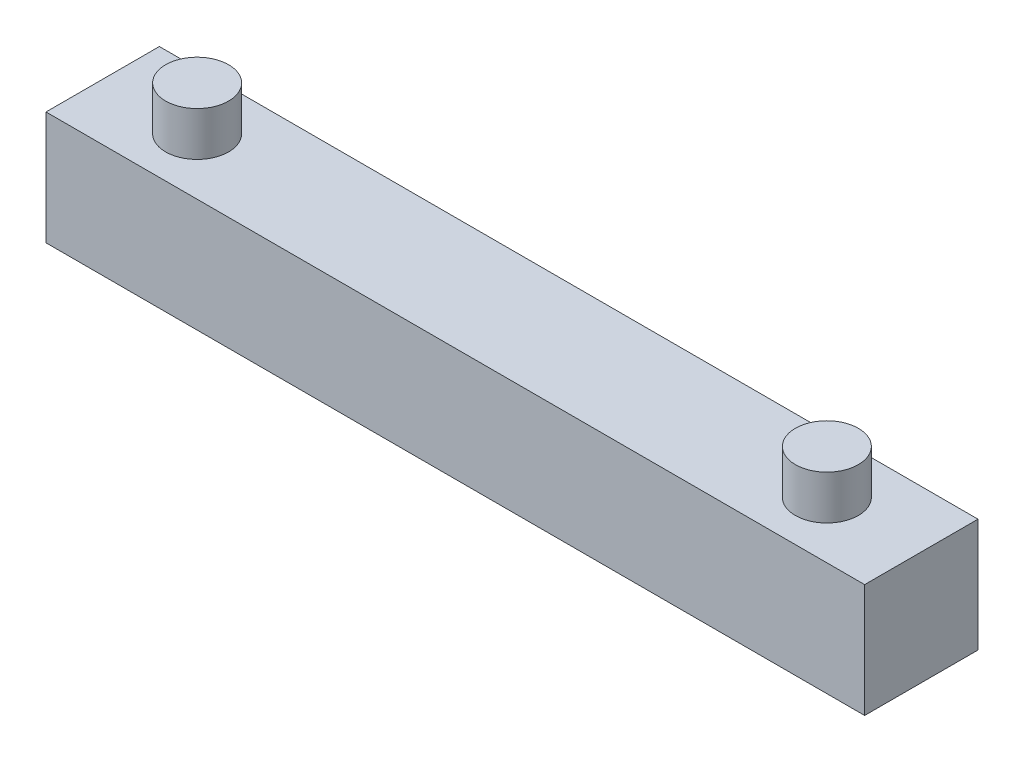
ISO-10303-21;
HEADER;
FILE_DESCRIPTION(('STEP AP214'),'2;1');
FILE_NAME('part.step','',(''),(''),'','','');
FILE_SCHEMA(('AUTOMOTIVE_DESIGN { 1 0 10303 214 1 1 1 1 }'));
ENDSEC;
DATA;
#1=APPLICATION_CONTEXT('core data for automotive mechanical design processes');
#2=APPLICATION_PROTOCOL_DEFINITION('international standard','automotive_design',2000,#1);
#3=PRODUCT_CONTEXT('',#1,'mechanical');
#4=PRODUCT('Part','Part','',(#3));
#5=PRODUCT_RELATED_PRODUCT_CATEGORY('part','',(#4));
#6=PRODUCT_DEFINITION_FORMATION('','',#4);
#7=PRODUCT_DEFINITION_CONTEXT('part definition',#1,'design');
#8=PRODUCT_DEFINITION('design','',#6,#7);
#9=PRODUCT_DEFINITION_SHAPE('','',#8);
#10=(LENGTH_UNIT() NAMED_UNIT(*) SI_UNIT(.MILLI.,.METRE.));
#11=(NAMED_UNIT(*) PLANE_ANGLE_UNIT() SI_UNIT($,.RADIAN.));
#12=(NAMED_UNIT(*) SI_UNIT($,.STERADIAN.) SOLID_ANGLE_UNIT());
#13=UNCERTAINTY_MEASURE_WITH_UNIT(LENGTH_MEASURE(1.E-05),#10,'distance_accuracy_value','');
#14=(GEOMETRIC_REPRESENTATION_CONTEXT(3) GLOBAL_UNCERTAINTY_ASSIGNED_CONTEXT((#13)) GLOBAL_UNIT_ASSIGNED_CONTEXT((#10,
#11,#12)) REPRESENTATION_CONTEXT('',''));
#15=CARTESIAN_POINT('',(0.,0.,0.));
#16=DIRECTION('',(0.,0.,1.));
#17=DIRECTION('',(1.,0.,0.));
#18=AXIS2_PLACEMENT_3D('',#15,#16,#17);
#19=CARTESIAN_POINT('',(32.5,9.,-4.5));
#20=DIRECTION('',(-1.,0.,0.));
#21=DIRECTION('',(0.,0.,1.));
#22=AXIS2_PLACEMENT_3D('',#19,#20,#21);
#23=PLANE('',#22);
#24=DIRECTION('',(0.,0.,-1.));
#25=VECTOR('',#24,1.);
#26=CARTESIAN_POINT('',(32.5,0.,-4.5));
#27=LINE('',#26,#25);
#28=CARTESIAN_POINT('',(32.5,0.,4.5));
#29=VERTEX_POINT('',#28);
#30=CARTESIAN_POINT('',(32.5,0.,-4.5));
#31=VERTEX_POINT('',#30);
#32=EDGE_CURVE('E111',#29,#31,#27,.T.);
#33=ORIENTED_EDGE('',*,*,#32,.T.);
#34=DIRECTION('',(0.,-1.,0.));
#35=VECTOR('',#34,1.);
#36=CARTESIAN_POINT('',(32.5,9.,-4.5));
#37=LINE('',#36,#35);
#38=CARTESIAN_POINT('',(32.5,9.,-4.5));
#39=VERTEX_POINT('',#38);
#40=EDGE_CURVE('E11',#39,#31,#37,.T.);
#41=ORIENTED_EDGE('',*,*,#40,.F.);
#42=DIRECTION('',(0.,0.,-1.));
#43=VECTOR('',#42,1.);
#44=CARTESIAN_POINT('',(32.5,9.,-4.5));
#45=LINE('',#44,#43);
#46=CARTESIAN_POINT('',(32.5,9.,4.5));
#47=VERTEX_POINT('',#46);
#48=EDGE_CURVE('E95',#47,#39,#45,.T.);
#49=ORIENTED_EDGE('',*,*,#48,.F.);
#50=DIRECTION('',(0.,-1.,0.));
#51=VECTOR('',#50,1.);
#52=CARTESIAN_POINT('',(32.5,9.,4.5));
#53=LINE('',#52,#51);
#54=EDGE_CURVE('E107',#47,#29,#53,.T.);
#55=ORIENTED_EDGE('',*,*,#54,.T.);
#56=EDGE_LOOP('',(#33,#41,#49,#55));
#57=FACE_BOUND('',#56,.T.);
#58=ADVANCED_FACE('F43',(#57),#23,.F.);
#59=CARTESIAN_POINT('',(-32.5,9.,-4.5));
#60=DIRECTION('',(0.,0.,1.));
#61=DIRECTION('',(1.,0.,0.));
#62=AXIS2_PLACEMENT_3D('',#59,#60,#61);
#63=PLANE('',#62);
#64=DIRECTION('',(-1.,0.,0.));
#65=VECTOR('',#64,1.);
#66=CARTESIAN_POINT('',(-32.5,0.,-4.5));
#67=LINE('',#66,#65);
#68=CARTESIAN_POINT('',(-32.5,0.,-4.5));
#69=VERTEX_POINT('',#68);
#70=EDGE_CURVE('E100',#31,#69,#67,.T.);
#71=ORIENTED_EDGE('',*,*,#70,.T.);
#72=DIRECTION('',(0.,-1.,0.));
#73=VECTOR('',#72,1.);
#74=CARTESIAN_POINT('',(-32.5,9.,-4.5));
#75=LINE('',#74,#73);
#76=CARTESIAN_POINT('',(-32.5,9.,-4.5));
#77=VERTEX_POINT('',#76);
#78=EDGE_CURVE('E52',#77,#69,#75,.T.);
#79=ORIENTED_EDGE('',*,*,#78,.F.);
#80=DIRECTION('',(-1.,0.,0.));
#81=VECTOR('',#80,1.);
#82=CARTESIAN_POINT('',(-32.5,9.,-4.5));
#83=LINE('',#82,#81);
#84=EDGE_CURVE('E90',#39,#77,#83,.T.);
#85=ORIENTED_EDGE('',*,*,#84,.F.);
#86=ORIENTED_EDGE('',*,*,#40,.T.);
#87=EDGE_LOOP('',(#71,#79,#85,#86));
#88=FACE_BOUND('',#87,.T.);
#89=ADVANCED_FACE('F99',(#88),#63,.F.);
#90=CARTESIAN_POINT('',(-32.5,9.,-4.5));
#91=DIRECTION('',(1.,0.,0.));
#92=DIRECTION('',(0.,0.,-1.));
#93=AXIS2_PLACEMENT_3D('',#90,#91,#92);
#94=PLANE('',#93);
#95=DIRECTION('',(0.,0.,1.));
#96=VECTOR('',#95,1.);
#97=CARTESIAN_POINT('',(-32.5,0.,-4.5));
#98=LINE('',#97,#96);
#99=CARTESIAN_POINT('',(-32.5,0.,4.5));
#100=VERTEX_POINT('',#99);
#101=EDGE_CURVE('E77',#69,#100,#98,.T.);
#102=ORIENTED_EDGE('',*,*,#101,.T.);
#103=DIRECTION('',(0.,-1.,0.));
#104=VECTOR('',#103,1.);
#105=CARTESIAN_POINT('',(-32.5,9.,4.5));
#106=LINE('',#105,#104);
#107=CARTESIAN_POINT('',(-32.5,9.,4.5));
#108=VERTEX_POINT('',#107);
#109=EDGE_CURVE('E102',#108,#100,#106,.T.);
#110=ORIENTED_EDGE('',*,*,#109,.F.);
#111=DIRECTION('',(0.,0.,1.));
#112=VECTOR('',#111,1.);
#113=CARTESIAN_POINT('',(-32.5,9.,-4.5));
#114=LINE('',#113,#112);
#115=EDGE_CURVE('E93',#77,#108,#114,.T.);
#116=ORIENTED_EDGE('',*,*,#115,.F.);
#117=ORIENTED_EDGE('',*,*,#78,.T.);
#118=EDGE_LOOP('',(#102,#110,#116,#117));
#119=FACE_BOUND('',#118,.T.);
#120=ADVANCED_FACE('F103',(#119),#94,.F.);
#121=CARTESIAN_POINT('',(-32.5,9.,4.5));
#122=DIRECTION('',(0.,0.,-1.));
#123=DIRECTION('',(-1.,0.,0.));
#124=AXIS2_PLACEMENT_3D('',#121,#122,#123);
#125=PLANE('',#124);
#126=DIRECTION('',(1.,0.,0.));
#127=VECTOR('',#126,1.);
#128=CARTESIAN_POINT('',(-32.5,0.,4.5));
#129=LINE('',#128,#127);
#130=EDGE_CURVE('E83',#100,#29,#129,.T.);
#131=ORIENTED_EDGE('',*,*,#130,.T.);
#132=ORIENTED_EDGE('',*,*,#54,.F.);
#133=DIRECTION('',(1.,0.,0.));
#134=VECTOR('',#133,1.);
#135=CARTESIAN_POINT('',(-32.5,9.,4.5));
#136=LINE('',#135,#134);
#137=EDGE_CURVE('E60',#108,#47,#136,.T.);
#138=ORIENTED_EDGE('',*,*,#137,.F.);
#139=ORIENTED_EDGE('',*,*,#109,.T.);
#140=EDGE_LOOP('',(#131,#132,#138,#139));
#141=FACE_BOUND('',#140,.T.);
#142=ADVANCED_FACE('F125',(#141),#125,.F.);
#143=CARTESIAN_POINT('',(0.,9.,0.));
#144=DIRECTION('',(0.,1.,0.));
#145=DIRECTION('',(0.,0.,1.));
#146=AXIS2_PLACEMENT_3D('',#143,#144,#145);
#147=PLANE('',#146);
#148=CARTESIAN_POINT('',(25.,9.,0.));
#149=DIRECTION('',(0.,1.,0.));
#150=DIRECTION('',(0.,0.,1.));
#151=AXIS2_PLACEMENT_3D('',#148,#149,#150);
#152=CIRCLE('',#151,2.5);
#153=CARTESIAN_POINT('',(25.,9.,2.5));
#154=VERTEX_POINT('',#153);
#155=EDGE_CURVE('E140',#154,#154,#152,.T.);
#156=ORIENTED_EDGE('',*,*,#155,.F.);
#157=EDGE_LOOP('',(#156));
#158=FACE_BOUND('',#157,.T.);
#159=CARTESIAN_POINT('',(-25.,9.,0.));
#160=DIRECTION('',(0.,1.,0.));
#161=DIRECTION('',(0.,0.,1.));
#162=AXIS2_PLACEMENT_3D('',#159,#160,#161);
#163=CIRCLE('',#162,2.5);
#164=CARTESIAN_POINT('',(-25.,9.,2.5));
#165=VERTEX_POINT('',#164);
#166=EDGE_CURVE('E132',#165,#165,#163,.T.);
#167=ORIENTED_EDGE('',*,*,#166,.F.);
#168=EDGE_LOOP('',(#167));
#169=FACE_BOUND('',#168,.T.);
#170=ORIENTED_EDGE('',*,*,#48,.T.);
#171=ORIENTED_EDGE('',*,*,#84,.T.);
#172=ORIENTED_EDGE('',*,*,#115,.T.);
#173=ORIENTED_EDGE('',*,*,#137,.T.);
#174=EDGE_LOOP('',(#170,#171,#172,#173));
#175=FACE_BOUND('',#174,.T.);
#176=ADVANCED_FACE('F91',(#158,#169,#175),#147,.T.);
#177=CARTESIAN_POINT('',(0.,0.,0.));
#178=DIRECTION('',(0.,1.,0.));
#179=DIRECTION('',(0.,0.,1.));
#180=AXIS2_PLACEMENT_3D('',#177,#178,#179);
#181=PLANE('',#180);
#182=ORIENTED_EDGE('',*,*,#32,.F.);
#183=ORIENTED_EDGE('',*,*,#130,.F.);
#184=ORIENTED_EDGE('',*,*,#101,.F.);
#185=ORIENTED_EDGE('',*,*,#70,.F.);
#186=EDGE_LOOP('',(#182,#183,#184,#185));
#187=FACE_BOUND('',#186,.T.);
#188=ADVANCED_FACE('F128',(#187),#181,.F.);
#189=CARTESIAN_POINT('',(-25.,12.5,0.));
#190=DIRECTION('',(0.,-1.,0.));
#191=DIRECTION('',(0.,0.,-1.));
#192=AXIS2_PLACEMENT_3D('',#189,#190,#191);
#193=CYLINDRICAL_SURFACE('',#192,2.5);
#194=CARTESIAN_POINT('',(-25.,12.5,0.));
#195=DIRECTION('',(0.,1.,0.));
#196=DIRECTION('',(0.,0.,1.));
#197=AXIS2_PLACEMENT_3D('',#194,#195,#196);
#198=CIRCLE('',#197,2.5);
#199=CARTESIAN_POINT('',(-25.,12.5,2.5));
#200=VERTEX_POINT('',#199);
#201=EDGE_CURVE('E115',#200,#200,#198,.T.);
#202=ORIENTED_EDGE('',*,*,#201,.F.);
#203=EDGE_LOOP('',(#202));
#204=FACE_BOUND('',#203,.T.);
#205=ORIENTED_EDGE('',*,*,#166,.T.);
#206=EDGE_LOOP('',(#205));
#207=FACE_BOUND('',#206,.T.);
#208=ADVANCED_FACE('F162',(#204,#207),#193,.T.);
#209=CARTESIAN_POINT('',(-25.,12.5,0.));
#210=DIRECTION('',(0.,1.,0.));
#211=DIRECTION('',(0.,0.,1.));
#212=AXIS2_PLACEMENT_3D('',#209,#210,#211);
#213=PLANE('',#212);
#214=ORIENTED_EDGE('',*,*,#201,.T.);
#215=EDGE_LOOP('',(#214));
#216=FACE_BOUND('',#215,.T.);
#217=ADVANCED_FACE('F153',(#216),#213,.T.);
#218=CARTESIAN_POINT('',(25.,12.5,0.));
#219=DIRECTION('',(0.,-1.,0.));
#220=DIRECTION('',(0.,0.,-1.));
#221=AXIS2_PLACEMENT_3D('',#218,#219,#220);
#222=CYLINDRICAL_SURFACE('',#221,2.5);
#223=CARTESIAN_POINT('',(25.,12.5,0.));
#224=DIRECTION('',(0.,1.,0.));
#225=DIRECTION('',(0.,0.,1.));
#226=AXIS2_PLACEMENT_3D('',#223,#224,#225);
#227=CIRCLE('',#226,2.5);
#228=CARTESIAN_POINT('',(25.,12.5,2.5));
#229=VERTEX_POINT('',#228);
#230=EDGE_CURVE('E136',#229,#229,#227,.T.);
#231=ORIENTED_EDGE('',*,*,#230,.F.);
#232=EDGE_LOOP('',(#231));
#233=FACE_BOUND('',#232,.T.);
#234=ORIENTED_EDGE('',*,*,#155,.T.);
#235=EDGE_LOOP('',(#234));
#236=FACE_BOUND('',#235,.T.);
#237=ADVANCED_FACE('F150',(#233,#236),#222,.T.);
#238=CARTESIAN_POINT('',(25.,12.5,0.));
#239=DIRECTION('',(0.,1.,0.));
#240=DIRECTION('',(0.,0.,1.));
#241=AXIS2_PLACEMENT_3D('',#238,#239,#240);
#242=PLANE('',#241);
#243=ORIENTED_EDGE('',*,*,#230,.T.);
#244=EDGE_LOOP('',(#243));
#245=FACE_BOUND('',#244,.T.);
#246=ADVANCED_FACE('F148',(#245),#242,.T.);
#247=CLOSED_SHELL('',(#58,#89,#120,#142,#176,#188,#208,#217,#237,#246));
#248=MANIFOLD_SOLID_BREP('B2',#247);
#249=ADVANCED_BREP_SHAPE_REPRESENTATION('',(#18,#248),#14);
#250=SHAPE_DEFINITION_REPRESENTATION(#9,#249);
ENDSEC;
END-ISO-10303-21;
